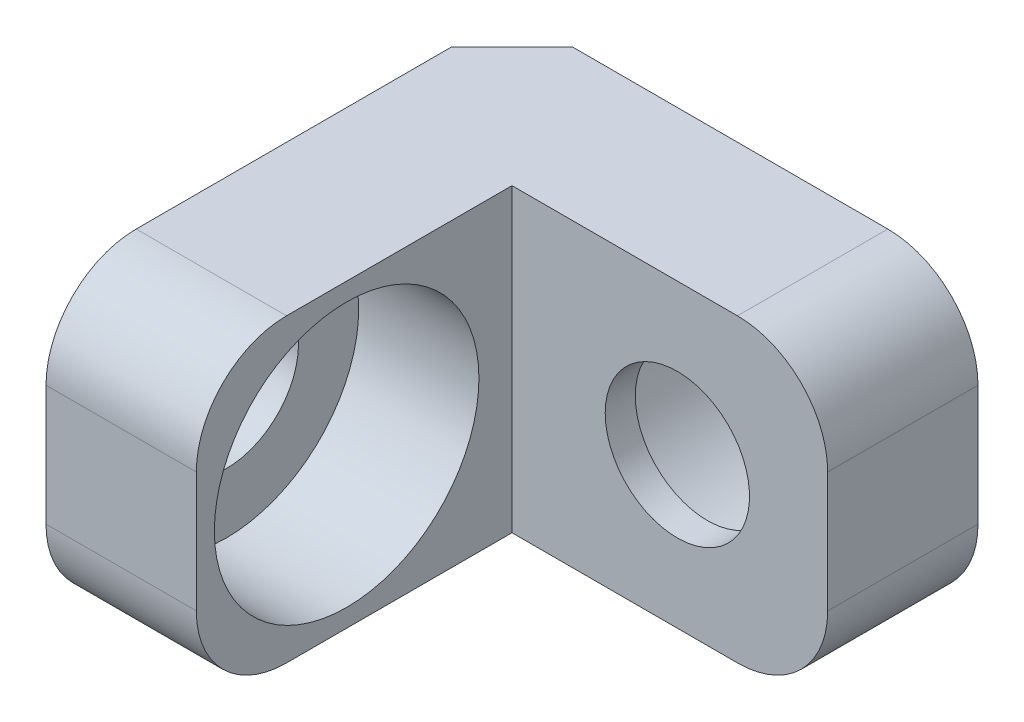
ISO-10303-21;
HEADER;
FILE_DESCRIPTION(('STEP AP214'),'2;1');
FILE_NAME('part.step','',(''),(''),'','','');
FILE_SCHEMA(('AUTOMOTIVE_DESIGN { 1 0 10303 214 1 1 1 1 }'));
ENDSEC;
DATA;
#1=APPLICATION_CONTEXT('core data for automotive mechanical design processes');
#2=APPLICATION_PROTOCOL_DEFINITION('international standard','automotive_design',2000,#1);
#3=PRODUCT_CONTEXT('',#1,'mechanical');
#4=PRODUCT('Part','Part','',(#3));
#5=PRODUCT_RELATED_PRODUCT_CATEGORY('part','',(#4));
#6=PRODUCT_DEFINITION_FORMATION('','',#4);
#7=PRODUCT_DEFINITION_CONTEXT('part definition',#1,'design');
#8=PRODUCT_DEFINITION('design','',#6,#7);
#9=PRODUCT_DEFINITION_SHAPE('','',#8);
#10=(LENGTH_UNIT() NAMED_UNIT(*) SI_UNIT(.MILLI.,.METRE.));
#11=(NAMED_UNIT(*) PLANE_ANGLE_UNIT() SI_UNIT($,.RADIAN.));
#12=(NAMED_UNIT(*) SI_UNIT($,.STERADIAN.) SOLID_ANGLE_UNIT());
#13=UNCERTAINTY_MEASURE_WITH_UNIT(LENGTH_MEASURE(1.E-05),#10,'distance_accuracy_value','');
#14=(GEOMETRIC_REPRESENTATION_CONTEXT(3) GLOBAL_UNCERTAINTY_ASSIGNED_CONTEXT((#13)) GLOBAL_UNIT_ASSIGNED_CONTEXT((#10,
#11,#12)) REPRESENTATION_CONTEXT('',''));
#15=CARTESIAN_POINT('',(0.,0.,0.));
#16=DIRECTION('',(0.,0.,1.));
#17=DIRECTION('',(1.,0.,0.));
#18=AXIS2_PLACEMENT_3D('',#15,#16,#17);
#19=CARTESIAN_POINT('',(2.5,5.,0.));
#20=DIRECTION('',(0.,0.,-1.));
#21=DIRECTION('',(-1.,0.,0.));
#22=AXIS2_PLACEMENT_3D('',#19,#20,#21);
#23=PLANE('',#22);
#24=DIRECTION('',(0.,-1.,0.));
#25=VECTOR('',#24,1.);
#26=CARTESIAN_POINT('',(0.,5.,0.));
#27=LINE('',#26,#25);
#28=CARTESIAN_POINT('',(0.,3.5,0.));
#29=VERTEX_POINT('',#28);
#30=CARTESIAN_POINT('',(0.,1.5,0.));
#31=VERTEX_POINT('',#30);
#32=EDGE_CURVE('E149',#29,#31,#27,.T.);
#33=ORIENTED_EDGE('',*,*,#32,.T.);
#34=DIRECTION('',(1.,0.,0.));
#35=VECTOR('',#34,1.);
#36=CARTESIAN_POINT('',(2.5,1.5,0.));
#37=LINE('',#36,#35);
#38=CARTESIAN_POINT('',(2.5,1.5,0.));
#39=VERTEX_POINT('',#38);
#40=EDGE_CURVE('E181',#31,#39,#37,.T.);
#41=ORIENTED_EDGE('',*,*,#40,.T.);
#42=DIRECTION('',(0.,-1.,0.));
#43=VECTOR('',#42,1.);
#44=CARTESIAN_POINT('',(2.5,5.,0.));
#45=LINE('',#44,#43);
#46=CARTESIAN_POINT('',(2.5,3.5,0.));
#47=VERTEX_POINT('',#46);
#48=EDGE_CURVE('E137',#47,#39,#45,.T.);
#49=ORIENTED_EDGE('',*,*,#48,.F.);
#50=DIRECTION('',(1.,0.,0.));
#51=VECTOR('',#50,1.);
#52=CARTESIAN_POINT('',(2.5,3.5,0.));
#53=LINE('',#52,#51);
#54=EDGE_CURVE('E176',#47,#29,#53,.F.);
#55=ORIENTED_EDGE('',*,*,#54,.T.);
#56=EDGE_LOOP('',(#33,#41,#49,#55));
#57=FACE_BOUND('',#56,.T.);
#58=ADVANCED_FACE('F33',(#57),#23,.F.);
#59=CARTESIAN_POINT('',(2.5,5.,-5.25));
#60=DIRECTION('',(-1.,0.,0.));
#61=DIRECTION('',(0.,0.,1.));
#62=AXIS2_PLACEMENT_3D('',#59,#60,#61);
#63=PLANE('',#62);
#64=CARTESIAN_POINT('',(2.5,2.5,-2.5));
#65=DIRECTION('',(1.,0.,0.));
#66=DIRECTION('',(0.,0.,-1.));
#67=AXIS2_PLACEMENT_3D('',#64,#65,#66);
#68=CIRCLE('',#67,2.19999999999999);
#69=CARTESIAN_POINT('',(2.5,2.5,-4.69999999999999));
#70=VERTEX_POINT('',#69);
#71=EDGE_CURVE('E401',#70,#70,#68,.T.);
#72=ORIENTED_EDGE('',*,*,#71,.F.);
#73=EDGE_LOOP('',(#72));
#74=FACE_BOUND('',#73,.T.);
#75=ORIENTED_EDGE('',*,*,#48,.T.);
#76=CARTESIAN_POINT('',(2.5,1.5,-1.5));
#77=DIRECTION('',(-1.,0.,0.));
#78=DIRECTION('',(0.,0.,1.));
#79=AXIS2_PLACEMENT_3D('',#76,#77,#78);
#80=CIRCLE('',#79,1.5);
#81=CARTESIAN_POINT('',(2.5,0.,-1.5));
#82=VERTEX_POINT('',#81);
#83=EDGE_CURVE('E186',#39,#82,#80,.F.);
#84=ORIENTED_EDGE('',*,*,#83,.T.);
#85=DIRECTION('',(0.,0.,-1.));
#86=VECTOR('',#85,1.);
#87=CARTESIAN_POINT('',(2.5,0.,-5.25));
#88=LINE('',#87,#86);
#89=CARTESIAN_POINT('',(2.5,0.,-5.25));
#90=VERTEX_POINT('',#89);
#91=EDGE_CURVE('E135',#82,#90,#88,.T.);
#92=ORIENTED_EDGE('',*,*,#91,.T.);
#93=DIRECTION('',(0.,-1.,0.));
#94=VECTOR('',#93,1.);
#95=CARTESIAN_POINT('',(2.5,5.,-5.25));
#96=LINE('',#95,#94);
#97=CARTESIAN_POINT('',(2.5,5.,-5.25));
#98=VERTEX_POINT('',#97);
#99=EDGE_CURVE('E131',#98,#90,#96,.T.);
#100=ORIENTED_EDGE('',*,*,#99,.F.);
#101=DIRECTION('',(0.,0.,-1.));
#102=VECTOR('',#101,1.);
#103=CARTESIAN_POINT('',(2.5,5.,-5.25));
#104=LINE('',#103,#102);
#105=CARTESIAN_POINT('',(2.5,5.,-1.5));
#106=VERTEX_POINT('',#105);
#107=EDGE_CURVE('E117',#106,#98,#104,.T.);
#108=ORIENTED_EDGE('',*,*,#107,.F.);
#109=CARTESIAN_POINT('',(2.5,3.5,-1.5));
#110=DIRECTION('',(-1.,0.,0.));
#111=DIRECTION('',(0.,0.,1.));
#112=AXIS2_PLACEMENT_3D('',#109,#110,#111);
#113=CIRCLE('',#112,1.5);
#114=EDGE_CURVE('E184',#106,#47,#113,.F.);
#115=ORIENTED_EDGE('',*,*,#114,.T.);
#116=EDGE_LOOP('',(#75,#84,#92,#100,#108,#115));
#117=FACE_BOUND('',#116,.T.);
#118=ADVANCED_FACE('F133',(#74,#117),#63,.F.);
#119=CARTESIAN_POINT('',(7.75,5.,-5.25));
#120=DIRECTION('',(0.,0.,-1.));
#121=DIRECTION('',(-1.,0.,0.));
#122=AXIS2_PLACEMENT_3D('',#119,#120,#121);
#123=PLANE('',#122);
#124=CARTESIAN_POINT('',(5.25,2.5,-5.25));
#125=DIRECTION('',(0.,0.,-1.));
#126=DIRECTION('',(-1.,0.,0.));
#127=AXIS2_PLACEMENT_3D('',#124,#125,#126);
#128=CIRCLE('',#127,1.2);
#129=CARTESIAN_POINT('',(4.05,2.5,-5.25));
#130=VERTEX_POINT('',#129);
#131=EDGE_CURVE('E152',#130,#130,#128,.T.);
#132=ORIENTED_EDGE('',*,*,#131,.T.);
#133=EDGE_LOOP('',(#132));
#134=FACE_BOUND('',#133,.T.);
#135=DIRECTION('',(1.,0.,0.));
#136=VECTOR('',#135,1.);
#137=CARTESIAN_POINT('',(7.75,0.,-5.25));
#138=LINE('',#137,#136);
#139=CARTESIAN_POINT('',(6.25,0.,-5.25));
#140=VERTEX_POINT('',#139);
#141=EDGE_CURVE('E151',#90,#140,#138,.T.);
#142=ORIENTED_EDGE('',*,*,#141,.T.);
#143=CARTESIAN_POINT('',(6.25,1.5,-5.25));
#144=DIRECTION('',(0.,0.,-1.));
#145=DIRECTION('',(-1.,0.,0.));
#146=AXIS2_PLACEMENT_3D('',#143,#144,#145);
#147=CIRCLE('',#146,1.5);
#148=CARTESIAN_POINT('',(7.75,1.5,-5.25));
#149=VERTEX_POINT('',#148);
#150=EDGE_CURVE('E11',#140,#149,#147,.F.);
#151=ORIENTED_EDGE('',*,*,#150,.T.);
#152=DIRECTION('',(0.,-1.,0.));
#153=VECTOR('',#152,1.);
#154=CARTESIAN_POINT('',(7.75,5.,-5.25));
#155=LINE('',#154,#153);
#156=CARTESIAN_POINT('',(7.75,3.5,-5.25));
#157=VERTEX_POINT('',#156);
#158=EDGE_CURVE('E138',#157,#149,#155,.T.);
#159=ORIENTED_EDGE('',*,*,#158,.F.);
#160=CARTESIAN_POINT('',(6.25,3.5,-5.25));
#161=DIRECTION('',(0.,0.,-1.));
#162=DIRECTION('',(-1.,0.,0.));
#163=AXIS2_PLACEMENT_3D('',#160,#161,#162);
#164=CIRCLE('',#163,1.5);
#165=CARTESIAN_POINT('',(6.25,5.,-5.25));
#166=VERTEX_POINT('',#165);
#167=EDGE_CURVE('E41',#157,#166,#164,.F.);
#168=ORIENTED_EDGE('',*,*,#167,.T.);
#169=DIRECTION('',(1.,0.,0.));
#170=VECTOR('',#169,1.);
#171=CARTESIAN_POINT('',(7.75,5.,-5.25));
#172=LINE('',#171,#170);
#173=EDGE_CURVE('E123',#98,#166,#172,.T.);
#174=ORIENTED_EDGE('',*,*,#173,.F.);
#175=ORIENTED_EDGE('',*,*,#99,.T.);
#176=EDGE_LOOP('',(#142,#151,#159,#168,#174,#175));
#177=FACE_BOUND('',#176,.T.);
#178=ADVANCED_FACE('F140',(#134,#177),#123,.F.);
#179=CARTESIAN_POINT('',(7.75,5.,-7.75));
#180=DIRECTION('',(-1.,0.,0.));
#181=DIRECTION('',(0.,0.,1.));
#182=AXIS2_PLACEMENT_3D('',#179,#180,#181);
#183=PLANE('',#182);
#184=ORIENTED_EDGE('',*,*,#158,.T.);
#185=DIRECTION('',(0.,0.,-1.));
#186=VECTOR('',#185,1.);
#187=CARTESIAN_POINT('',(7.75,1.5,-7.75));
#188=LINE('',#187,#186);
#189=CARTESIAN_POINT('',(7.75,1.5,-7.75));
#190=VERTEX_POINT('',#189);
#191=EDGE_CURVE('E200',#149,#190,#188,.T.);
#192=ORIENTED_EDGE('',*,*,#191,.T.);
#193=DIRECTION('',(0.,-1.,0.));
#194=VECTOR('',#193,1.);
#195=CARTESIAN_POINT('',(7.75,5.,-7.75));
#196=LINE('',#195,#194);
#197=CARTESIAN_POINT('',(7.75,3.5,-7.75));
#198=VERTEX_POINT('',#197);
#199=EDGE_CURVE('E160',#198,#190,#196,.T.);
#200=ORIENTED_EDGE('',*,*,#199,.F.);
#201=DIRECTION('',(0.,0.,-1.));
#202=VECTOR('',#201,1.);
#203=CARTESIAN_POINT('',(7.75,3.5,-7.75));
#204=LINE('',#203,#202);
#205=EDGE_CURVE('E53',#198,#157,#204,.F.);
#206=ORIENTED_EDGE('',*,*,#205,.T.);
#207=EDGE_LOOP('',(#184,#192,#200,#206));
#208=FACE_BOUND('',#207,.T.);
#209=ADVANCED_FACE('F217',(#208),#183,.F.);
#210=CARTESIAN_POINT('',(0.,5.,-7.75));
#211=DIRECTION('',(0.,0.,1.));
#212=DIRECTION('',(1.,0.,0.));
#213=AXIS2_PLACEMENT_3D('',#210,#211,#212);
#214=PLANE('',#213);
#215=CARTESIAN_POINT('',(5.25,2.5,-7.75));
#216=DIRECTION('',(0.,0.,-1.));
#217=DIRECTION('',(-1.,0.,0.));
#218=AXIS2_PLACEMENT_3D('',#215,#216,#217);
#219=CIRCLE('',#218,2.2);
#220=CARTESIAN_POINT('',(3.05,2.5,-7.75));
#221=VERTEX_POINT('',#220);
#222=EDGE_CURVE('E411',#221,#221,#219,.T.);
#223=ORIENTED_EDGE('',*,*,#222,.F.);
#224=EDGE_LOOP('',(#223));
#225=FACE_BOUND('',#224,.T.);
#226=ORIENTED_EDGE('',*,*,#199,.T.);
#227=CARTESIAN_POINT('',(6.25,1.5,-7.75));
#228=DIRECTION('',(0.,0.,1.));
#229=DIRECTION('',(1.,0.,0.));
#230=AXIS2_PLACEMENT_3D('',#227,#228,#229);
#231=CIRCLE('',#230,1.5);
#232=CARTESIAN_POINT('',(6.25,0.,-7.75));
#233=VERTEX_POINT('',#232);
#234=EDGE_CURVE('E205',#190,#233,#231,.F.);
#235=ORIENTED_EDGE('',*,*,#234,.T.);
#236=DIRECTION('',(-1.,0.,0.));
#237=VECTOR('',#236,1.);
#238=CARTESIAN_POINT('',(0.,0.,-7.75));
#239=LINE('',#238,#237);
#240=CARTESIAN_POINT('',(1.,0.,-7.75));
#241=VERTEX_POINT('',#240);
#242=EDGE_CURVE('E154',#233,#241,#239,.T.);
#243=ORIENTED_EDGE('',*,*,#242,.T.);
#244=DIRECTION('',(0.,1.,0.));
#245=VECTOR('',#244,1.);
#246=CARTESIAN_POINT('',(1.,5.,-7.75));
#247=LINE('',#246,#245);
#248=CARTESIAN_POINT('',(1.,5.,-7.75));
#249=VERTEX_POINT('',#248);
#250=EDGE_CURVE('E171',#241,#249,#247,.T.);
#251=ORIENTED_EDGE('',*,*,#250,.T.);
#252=DIRECTION('',(-1.,0.,0.));
#253=VECTOR('',#252,1.);
#254=CARTESIAN_POINT('',(0.,5.,-7.75));
#255=LINE('',#254,#253);
#256=CARTESIAN_POINT('',(6.25,5.,-7.75));
#257=VERTEX_POINT('',#256);
#258=EDGE_CURVE('E142',#257,#249,#255,.T.);
#259=ORIENTED_EDGE('',*,*,#258,.F.);
#260=CARTESIAN_POINT('',(6.25,3.5,-7.75));
#261=DIRECTION('',(0.,0.,1.));
#262=DIRECTION('',(1.,0.,0.));
#263=AXIS2_PLACEMENT_3D('',#260,#261,#262);
#264=CIRCLE('',#263,1.5);
#265=EDGE_CURVE('E203',#257,#198,#264,.F.);
#266=ORIENTED_EDGE('',*,*,#265,.T.);
#267=EDGE_LOOP('',(#226,#235,#243,#251,#259,#266));
#268=FACE_BOUND('',#267,.T.);
#269=ADVANCED_FACE('F208',(#225,#268),#214,.F.);
#270=CARTESIAN_POINT('',(0.,5.,0.));
#271=DIRECTION('',(1.,0.,0.));
#272=DIRECTION('',(0.,0.,-1.));
#273=AXIS2_PLACEMENT_3D('',#270,#271,#272);
#274=PLANE('',#273);
#275=CARTESIAN_POINT('',(0.,2.5,-2.5));
#276=DIRECTION('',(1.,0.,0.));
#277=DIRECTION('',(0.,0.,-1.));
#278=AXIS2_PLACEMENT_3D('',#275,#276,#277);
#279=CIRCLE('',#278,1.2);
#280=CARTESIAN_POINT('',(0.,2.5,-3.7));
#281=VERTEX_POINT('',#280);
#282=EDGE_CURVE('E408',#281,#281,#279,.T.);
#283=ORIENTED_EDGE('',*,*,#282,.T.);
#284=EDGE_LOOP('',(#283));
#285=FACE_BOUND('',#284,.T.);
#286=DIRECTION('',(0.,0.,1.));
#287=VECTOR('',#286,1.);
#288=CARTESIAN_POINT('',(0.,0.,0.));
#289=LINE('',#288,#287);
#290=CARTESIAN_POINT('',(0.,0.,-6.75));
#291=VERTEX_POINT('',#290);
#292=CARTESIAN_POINT('',(0.,0.,-1.5));
#293=VERTEX_POINT('',#292);
#294=EDGE_CURVE('E128',#291,#293,#289,.T.);
#295=ORIENTED_EDGE('',*,*,#294,.T.);
#296=CARTESIAN_POINT('',(0.,1.5,-1.5));
#297=DIRECTION('',(1.,0.,0.));
#298=DIRECTION('',(0.,0.,-1.));
#299=AXIS2_PLACEMENT_3D('',#296,#297,#298);
#300=CIRCLE('',#299,1.5);
#301=EDGE_CURVE('E194',#293,#31,#300,.F.);
#302=ORIENTED_EDGE('',*,*,#301,.T.);
#303=ORIENTED_EDGE('',*,*,#32,.F.);
#304=CARTESIAN_POINT('',(0.,3.5,-1.5));
#305=DIRECTION('',(1.,0.,0.));
#306=DIRECTION('',(0.,0.,-1.));
#307=AXIS2_PLACEMENT_3D('',#304,#305,#306);
#308=CIRCLE('',#307,1.5);
#309=CARTESIAN_POINT('',(0.,5.,-1.5));
#310=VERTEX_POINT('',#309);
#311=EDGE_CURVE('E192',#29,#310,#308,.F.);
#312=ORIENTED_EDGE('',*,*,#311,.T.);
#313=DIRECTION('',(0.,0.,1.));
#314=VECTOR('',#313,1.);
#315=CARTESIAN_POINT('',(0.,5.,0.));
#316=LINE('',#315,#314);
#317=CARTESIAN_POINT('',(0.,5.,-6.75));
#318=VERTEX_POINT('',#317);
#319=EDGE_CURVE('E144',#318,#310,#316,.T.);
#320=ORIENTED_EDGE('',*,*,#319,.F.);
#321=DIRECTION('',(0.,-1.,0.));
#322=VECTOR('',#321,1.);
#323=CARTESIAN_POINT('',(0.,5.,-6.75));
#324=LINE('',#323,#322);
#325=EDGE_CURVE('E165',#318,#291,#324,.T.);
#326=ORIENTED_EDGE('',*,*,#325,.T.);
#327=EDGE_LOOP('',(#295,#302,#303,#312,#320,#326));
#328=FACE_BOUND('',#327,.T.);
#329=ADVANCED_FACE('F226',(#285,#328),#274,.F.);
#330=CARTESIAN_POINT('',(0.,5.,0.));
#331=DIRECTION('',(0.,-1.,0.));
#332=DIRECTION('',(0.,0.,-1.));
#333=AXIS2_PLACEMENT_3D('',#330,#331,#332);
#334=PLANE('',#333);
#335=ORIENTED_EDGE('',*,*,#319,.T.);
#336=DIRECTION('',(1.,0.,0.));
#337=VECTOR('',#336,1.);
#338=CARTESIAN_POINT('',(0.,5.,-1.5));
#339=LINE('',#338,#337);
#340=EDGE_CURVE('E126',#310,#106,#339,.T.);
#341=ORIENTED_EDGE('',*,*,#340,.T.);
#342=ORIENTED_EDGE('',*,*,#107,.T.);
#343=ORIENTED_EDGE('',*,*,#173,.T.);
#344=DIRECTION('',(0.,0.,-1.));
#345=VECTOR('',#344,1.);
#346=CARTESIAN_POINT('',(6.25,5.,0.));
#347=LINE('',#346,#345);
#348=EDGE_CURVE('E196',#166,#257,#347,.T.);
#349=ORIENTED_EDGE('',*,*,#348,.T.);
#350=ORIENTED_EDGE('',*,*,#258,.T.);
#351=DIRECTION('',(0.707106781186549,0.,-0.707106781186546));
#352=VECTOR('',#351,1.);
#353=CARTESIAN_POINT('',(0.,5.,-6.75));
#354=LINE('',#353,#352);
#355=EDGE_CURVE('E174',#249,#318,#354,.F.);
#356=ORIENTED_EDGE('',*,*,#355,.T.);
#357=EDGE_LOOP('',(#335,#341,#342,#343,#349,#350,#356));
#358=FACE_BOUND('',#357,.T.);
#359=ADVANCED_FACE('F120',(#358),#334,.F.);
#360=CARTESIAN_POINT('',(0.,0.,0.));
#361=DIRECTION('',(0.,-1.,0.));
#362=DIRECTION('',(0.,0.,-1.));
#363=AXIS2_PLACEMENT_3D('',#360,#361,#362);
#364=PLANE('',#363);
#365=ORIENTED_EDGE('',*,*,#91,.F.);
#366=DIRECTION('',(1.,0.,0.));
#367=VECTOR('',#366,1.);
#368=CARTESIAN_POINT('',(0.,0.,-1.5));
#369=LINE('',#368,#367);
#370=EDGE_CURVE('E190',#82,#293,#369,.F.);
#371=ORIENTED_EDGE('',*,*,#370,.T.);
#372=ORIENTED_EDGE('',*,*,#294,.F.);
#373=DIRECTION('',(-0.707106781186549,0.,0.707106781186546));
#374=VECTOR('',#373,1.);
#375=CARTESIAN_POINT('',(-3.375,0.,-3.37500000000001));
#376=LINE('',#375,#374);
#377=EDGE_CURVE('E168',#291,#241,#376,.F.);
#378=ORIENTED_EDGE('',*,*,#377,.T.);
#379=ORIENTED_EDGE('',*,*,#242,.F.);
#380=DIRECTION('',(0.,0.,-1.));
#381=VECTOR('',#380,1.);
#382=CARTESIAN_POINT('',(6.25,0.,-5.25));
#383=LINE('',#382,#381);
#384=EDGE_CURVE('E188',#233,#140,#383,.F.);
#385=ORIENTED_EDGE('',*,*,#384,.T.);
#386=ORIENTED_EDGE('',*,*,#141,.F.);
#387=EDGE_LOOP('',(#365,#371,#372,#378,#379,#385,#386));
#388=FACE_BOUND('',#387,.T.);
#389=ADVANCED_FACE('F213',(#388),#364,.T.);
#390=CARTESIAN_POINT('',(0.,5.,-6.75));
#391=DIRECTION('',(0.707106781186546,0.,0.707106781186549));
#392=DIRECTION('',(0.,-1.,0.));
#393=AXIS2_PLACEMENT_3D('',#390,#391,#392);
#394=PLANE('',#393);
#395=ORIENTED_EDGE('',*,*,#355,.F.);
#396=ORIENTED_EDGE('',*,*,#250,.F.);
#397=ORIENTED_EDGE('',*,*,#377,.F.);
#398=ORIENTED_EDGE('',*,*,#325,.F.);
#399=EDGE_LOOP('',(#395,#396,#397,#398));
#400=FACE_BOUND('',#399,.T.);
#401=ADVANCED_FACE('F223',(#400),#394,.F.);
#402=CARTESIAN_POINT('',(5.25,2.5,-7.75));
#403=DIRECTION('',(0.,0.,-1.));
#404=DIRECTION('',(-1.,0.,0.));
#405=AXIS2_PLACEMENT_3D('',#402,#403,#404);
#406=CYLINDRICAL_SURFACE('',#405,1.2);
#407=CARTESIAN_POINT('',(5.25,2.5,-5.75));
#408=DIRECTION('',(0.,0.,-1.));
#409=DIRECTION('',(-1.,0.,0.));
#410=AXIS2_PLACEMENT_3D('',#407,#408,#409);
#411=CIRCLE('',#410,1.2);
#412=CARTESIAN_POINT('',(4.05,2.5,-5.75));
#413=VERTEX_POINT('',#412);
#414=EDGE_CURVE('E179',#413,#413,#411,.T.);
#415=ORIENTED_EDGE('',*,*,#414,.T.);
#416=EDGE_LOOP('',(#415));
#417=FACE_BOUND('',#416,.T.);
#418=ORIENTED_EDGE('',*,*,#131,.F.);
#419=EDGE_LOOP('',(#418));
#420=FACE_BOUND('',#419,.T.);
#421=ADVANCED_FACE('F260',(#417,#420),#406,.F.);
#422=CARTESIAN_POINT('',(6.45,2.5,-5.75));
#423=DIRECTION('',(0.,0.,1.));
#424=DIRECTION('',(1.,0.,0.));
#425=AXIS2_PLACEMENT_3D('',#422,#423,#424);
#426=PLANE('',#425);
#427=ORIENTED_EDGE('',*,*,#414,.F.);
#428=EDGE_LOOP('',(#427));
#429=FACE_BOUND('',#428,.T.);
#430=CARTESIAN_POINT('',(5.25,2.5,-5.75));
#431=DIRECTION('',(0.,0.,-1.));
#432=DIRECTION('',(-1.,0.,0.));
#433=AXIS2_PLACEMENT_3D('',#430,#431,#432);
#434=CIRCLE('',#433,2.2);
#435=CARTESIAN_POINT('',(3.05,2.5,-5.75));
#436=VERTEX_POINT('',#435);
#437=EDGE_CURVE('E414',#436,#436,#434,.T.);
#438=ORIENTED_EDGE('',*,*,#437,.T.);
#439=EDGE_LOOP('',(#438));
#440=FACE_BOUND('',#439,.T.);
#441=ADVANCED_FACE('F247',(#429,#440),#426,.F.);
#442=CARTESIAN_POINT('',(5.25,2.5,-7.75));
#443=DIRECTION('',(0.,0.,-1.));
#444=DIRECTION('',(-1.,0.,0.));
#445=AXIS2_PLACEMENT_3D('',#442,#443,#444);
#446=CYLINDRICAL_SURFACE('',#445,2.2);
#447=ORIENTED_EDGE('',*,*,#437,.F.);
#448=EDGE_LOOP('',(#447));
#449=FACE_BOUND('',#448,.T.);
#450=ORIENTED_EDGE('',*,*,#222,.T.);
#451=EDGE_LOOP('',(#450));
#452=FACE_BOUND('',#451,.T.);
#453=ADVANCED_FACE('F240',(#449,#452),#446,.F.);
#454=CARTESIAN_POINT('',(2.5,1.5,-1.5));
#455=DIRECTION('',(-1.,0.,0.));
#456=DIRECTION('',(0.,0.,1.));
#457=AXIS2_PLACEMENT_3D('',#454,#455,#456);
#458=CYLINDRICAL_SURFACE('',#457,1.5);
#459=ORIENTED_EDGE('',*,*,#301,.F.);
#460=ORIENTED_EDGE('',*,*,#370,.F.);
#461=ORIENTED_EDGE('',*,*,#83,.F.);
#462=ORIENTED_EDGE('',*,*,#40,.F.);
#463=EDGE_LOOP('',(#459,#460,#461,#462));
#464=FACE_BOUND('',#463,.T.);
#465=ADVANCED_FACE('F237',(#464),#458,.T.);
#466=CARTESIAN_POINT('',(0.,3.5,-1.5));
#467=DIRECTION('',(1.,0.,0.));
#468=DIRECTION('',(0.,0.,-1.));
#469=AXIS2_PLACEMENT_3D('',#466,#467,#468);
#470=CYLINDRICAL_SURFACE('',#469,1.5);
#471=ORIENTED_EDGE('',*,*,#311,.F.);
#472=ORIENTED_EDGE('',*,*,#54,.F.);
#473=ORIENTED_EDGE('',*,*,#114,.F.);
#474=ORIENTED_EDGE('',*,*,#340,.F.);
#475=EDGE_LOOP('',(#471,#472,#473,#474));
#476=FACE_BOUND('',#475,.T.);
#477=ADVANCED_FACE('F231',(#476),#470,.T.);
#478=CARTESIAN_POINT('',(6.25,1.5,-7.75));
#479=DIRECTION('',(0.,0.,1.));
#480=DIRECTION('',(1.,0.,0.));
#481=AXIS2_PLACEMENT_3D('',#478,#479,#480);
#482=CYLINDRICAL_SURFACE('',#481,1.5);
#483=ORIENTED_EDGE('',*,*,#150,.F.);
#484=ORIENTED_EDGE('',*,*,#384,.F.);
#485=ORIENTED_EDGE('',*,*,#234,.F.);
#486=ORIENTED_EDGE('',*,*,#191,.F.);
#487=EDGE_LOOP('',(#483,#484,#485,#486));
#488=FACE_BOUND('',#487,.T.);
#489=ADVANCED_FACE('F216',(#488),#482,.T.);
#490=CARTESIAN_POINT('',(6.25,3.5,0.));
#491=DIRECTION('',(0.,0.,-1.));
#492=DIRECTION('',(-1.,0.,0.));
#493=AXIS2_PLACEMENT_3D('',#490,#491,#492);
#494=CYLINDRICAL_SURFACE('',#493,1.5);
#495=ORIENTED_EDGE('',*,*,#167,.F.);
#496=ORIENTED_EDGE('',*,*,#205,.F.);
#497=ORIENTED_EDGE('',*,*,#265,.F.);
#498=ORIENTED_EDGE('',*,*,#348,.F.);
#499=EDGE_LOOP('',(#495,#496,#497,#498));
#500=FACE_BOUND('',#499,.T.);
#501=ADVANCED_FACE('F35',(#500),#494,.T.);
#502=CARTESIAN_POINT('',(2.5,2.5,-2.5));
#503=DIRECTION('',(1.,0.,0.));
#504=DIRECTION('',(0.,0.,-1.));
#505=AXIS2_PLACEMENT_3D('',#502,#503,#504);
#506=CYLINDRICAL_SURFACE('',#505,1.20000000000001);
#507=ORIENTED_EDGE('',*,*,#282,.F.);
#508=EDGE_LOOP('',(#507));
#509=FACE_BOUND('',#508,.T.);
#510=CARTESIAN_POINT('',(0.499999999999999,2.5,-2.5));
#511=DIRECTION('',(1.,0.,0.));
#512=DIRECTION('',(0.,0.,-1.));
#513=AXIS2_PLACEMENT_3D('',#510,#511,#512);
#514=CIRCLE('',#513,1.20000000000001);
#515=CARTESIAN_POINT('',(0.499999999999999,2.5,-3.70000000000001));
#516=VERTEX_POINT('',#515);
#517=EDGE_CURVE('E403',#516,#516,#514,.T.);
#518=ORIENTED_EDGE('',*,*,#517,.T.);
#519=EDGE_LOOP('',(#518));
#520=FACE_BOUND('',#519,.T.);
#521=ADVANCED_FACE('F336',(#509,#520),#506,.F.);
#522=CARTESIAN_POINT('',(0.499999999999999,3.70000000000001,-2.5));
#523=DIRECTION('',(-1.,0.,0.));
#524=DIRECTION('',(0.,0.,1.));
#525=AXIS2_PLACEMENT_3D('',#522,#523,#524);
#526=PLANE('',#525);
#527=ORIENTED_EDGE('',*,*,#517,.F.);
#528=EDGE_LOOP('',(#527));
#529=FACE_BOUND('',#528,.T.);
#530=CARTESIAN_POINT('',(0.499999999999999,2.5,-2.5));
#531=DIRECTION('',(1.,0.,0.));
#532=DIRECTION('',(0.,0.,-1.));
#533=AXIS2_PLACEMENT_3D('',#530,#531,#532);
#534=CIRCLE('',#533,2.19999999999999);
#535=CARTESIAN_POINT('',(0.499999999999999,2.5,-4.7));
#536=VERTEX_POINT('',#535);
#537=EDGE_CURVE('E398',#536,#536,#534,.T.);
#538=ORIENTED_EDGE('',*,*,#537,.T.);
#539=EDGE_LOOP('',(#538));
#540=FACE_BOUND('',#539,.T.);
#541=ADVANCED_FACE('F385',(#529,#540),#526,.F.);
#542=CARTESIAN_POINT('',(2.5,2.5,-2.5));
#543=DIRECTION('',(1.,0.,0.));
#544=DIRECTION('',(0.,0.,-1.));
#545=AXIS2_PLACEMENT_3D('',#542,#543,#544);
#546=CYLINDRICAL_SURFACE('',#545,2.19999999999999);
#547=ORIENTED_EDGE('',*,*,#537,.F.);
#548=EDGE_LOOP('',(#547));
#549=FACE_BOUND('',#548,.T.);
#550=ORIENTED_EDGE('',*,*,#71,.T.);
#551=EDGE_LOOP('',(#550));
#552=FACE_BOUND('',#551,.T.);
#553=ADVANCED_FACE('F389',(#549,#552),#546,.F.);
#554=CLOSED_SHELL('',(#58,#118,#178,#209,#269,#329,#359,#389,#401,#421,#441,#453,#465,#477,#489,
#501,#521,#541,#553));
#555=MANIFOLD_SOLID_BREP('B2',#554);
#556=ADVANCED_BREP_SHAPE_REPRESENTATION('',(#18,#555),#14);
#557=SHAPE_DEFINITION_REPRESENTATION(#9,#556);
ENDSEC;
END-ISO-10303-21;
